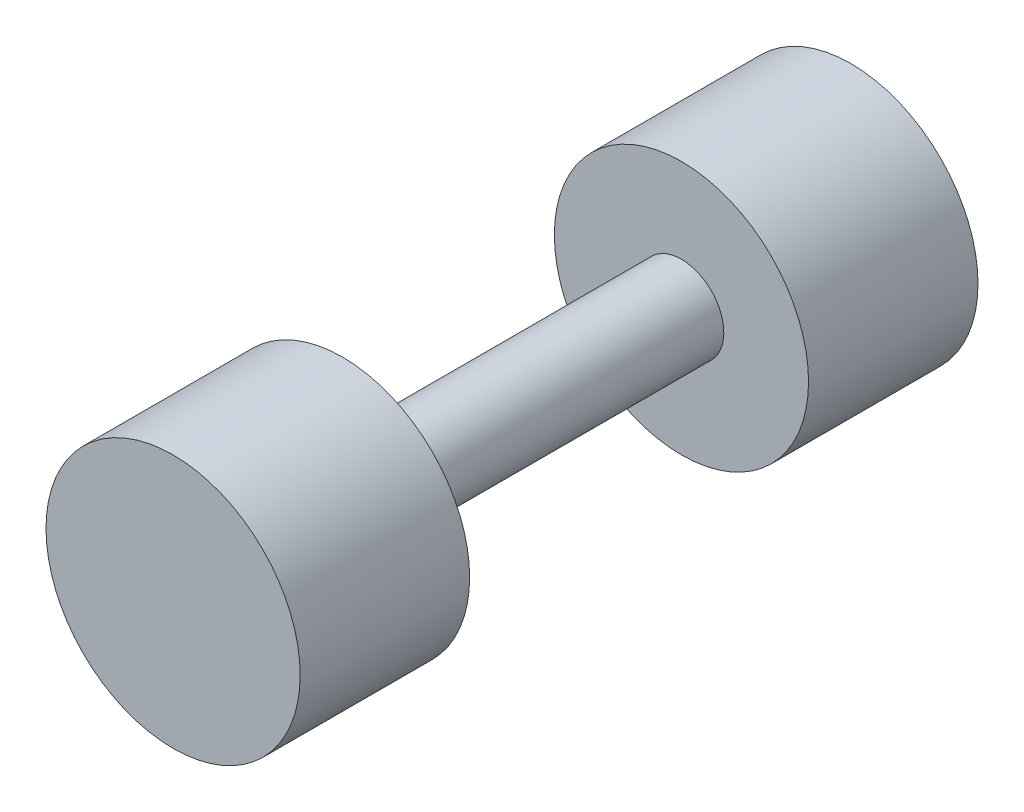
ISO-10303-21;
HEADER;
FILE_DESCRIPTION(('STEP AP214'),'2;1');
FILE_NAME('part.step','',(''),(''),'','','');
FILE_SCHEMA(('AUTOMOTIVE_DESIGN { 1 0 10303 214 1 1 1 1 }'));
ENDSEC;
DATA;
#1=APPLICATION_CONTEXT('core data for automotive mechanical design processes');
#2=APPLICATION_PROTOCOL_DEFINITION('international standard','automotive_design',2000,#1);
#3=PRODUCT_CONTEXT('',#1,'mechanical');
#4=PRODUCT('Part','Part','',(#3));
#5=PRODUCT_RELATED_PRODUCT_CATEGORY('part','',(#4));
#6=PRODUCT_DEFINITION_FORMATION('','',#4);
#7=PRODUCT_DEFINITION_CONTEXT('part definition',#1,'design');
#8=PRODUCT_DEFINITION('design','',#6,#7);
#9=PRODUCT_DEFINITION_SHAPE('','',#8);
#10=(LENGTH_UNIT() NAMED_UNIT(*) SI_UNIT(.MILLI.,.METRE.));
#11=(NAMED_UNIT(*) PLANE_ANGLE_UNIT() SI_UNIT($,.RADIAN.));
#12=(NAMED_UNIT(*) SI_UNIT($,.STERADIAN.) SOLID_ANGLE_UNIT());
#13=UNCERTAINTY_MEASURE_WITH_UNIT(LENGTH_MEASURE(1.E-05),#10,'distance_accuracy_value','');
#14=(GEOMETRIC_REPRESENTATION_CONTEXT(3) GLOBAL_UNCERTAINTY_ASSIGNED_CONTEXT((#13)) GLOBAL_UNIT_ASSIGNED_CONTEXT((#10,
#11,#12)) REPRESENTATION_CONTEXT('',''));
#15=CARTESIAN_POINT('',(0.,0.,0.));
#16=DIRECTION('',(0.,0.,1.));
#17=DIRECTION('',(1.,0.,0.));
#18=AXIS2_PLACEMENT_3D('',#15,#16,#17);
#19=CARTESIAN_POINT('',(0.,0.,-50.8));
#20=DIRECTION('',(0.,0.,-1.));
#21=DIRECTION('',(0.,1.,0.));
#22=AXIS2_PLACEMENT_3D('',#19,#20,#21);
#23=CYLINDRICAL_SURFACE('',#22,19.05);
#24=CARTESIAN_POINT('',(0.,0.,-25.4));
#25=DIRECTION('',(0.,0.,-1.));
#26=DIRECTION('',(0.,1.,0.));
#27=AXIS2_PLACEMENT_3D('',#24,#25,#26);
#28=CIRCLE('',#27,19.05);
#29=CARTESIAN_POINT('',(0.,19.05,-25.4));
#30=VERTEX_POINT('',#29);
#31=EDGE_CURVE('E53',#30,#30,#28,.T.);
#32=ORIENTED_EDGE('',*,*,#31,.T.);
#33=EDGE_LOOP('',(#32));
#34=FACE_BOUND('',#33,.T.);
#35=CARTESIAN_POINT('',(0.,0.,-50.8));
#36=DIRECTION('',(0.,0.,-1.));
#37=DIRECTION('',(0.,1.,0.));
#38=AXIS2_PLACEMENT_3D('',#35,#36,#37);
#39=CIRCLE('',#38,19.05);
#40=CARTESIAN_POINT('',(0.,19.05,-50.8));
#41=VERTEX_POINT('',#40);
#42=EDGE_CURVE('E10',#41,#41,#39,.T.);
#43=ORIENTED_EDGE('',*,*,#42,.F.);
#44=EDGE_LOOP('',(#43));
#45=FACE_BOUND('',#44,.T.);
#46=ADVANCED_FACE('F31',(#34,#45),#23,.T.);
#47=CARTESIAN_POINT('',(0.,19.05,-50.8));
#48=DIRECTION('',(0.,0.,-1.));
#49=DIRECTION('',(0.,1.,0.));
#50=AXIS2_PLACEMENT_3D('',#47,#48,#49);
#51=PLANE('',#50);
#52=ORIENTED_EDGE('',*,*,#42,.T.);
#53=EDGE_LOOP('',(#52));
#54=FACE_BOUND('',#53,.T.);
#55=ADVANCED_FACE('F71',(#54),#51,.T.);
#56=CARTESIAN_POINT('',(0.,0.,50.8));
#57=DIRECTION('',(0.,0.,1.));
#58=DIRECTION('',(0.,-1.,0.));
#59=AXIS2_PLACEMENT_3D('',#56,#57,#58);
#60=PLANE('',#59);
#61=CARTESIAN_POINT('',(0.,0.,50.8));
#62=DIRECTION('',(0.,0.,-1.));
#63=DIRECTION('',(0.,1.,0.));
#64=AXIS2_PLACEMENT_3D('',#61,#62,#63);
#65=CIRCLE('',#64,19.05);
#66=CARTESIAN_POINT('',(0.,19.05,50.8));
#67=VERTEX_POINT('',#66);
#68=EDGE_CURVE('E37',#67,#67,#65,.T.);
#69=ORIENTED_EDGE('',*,*,#68,.F.);
#70=EDGE_LOOP('',(#69));
#71=FACE_BOUND('',#70,.T.);
#72=ADVANCED_FACE('F75',(#71),#60,.T.);
#73=CARTESIAN_POINT('',(0.,0.,-50.8));
#74=DIRECTION('',(0.,0.,-1.));
#75=DIRECTION('',(0.,1.,0.));
#76=AXIS2_PLACEMENT_3D('',#73,#74,#75);
#77=CYLINDRICAL_SURFACE('',#76,19.05);
#78=ORIENTED_EDGE('',*,*,#68,.T.);
#79=EDGE_LOOP('',(#78));
#80=FACE_BOUND('',#79,.T.);
#81=CARTESIAN_POINT('',(0.,0.,25.4));
#82=DIRECTION('',(0.,0.,-1.));
#83=DIRECTION('',(0.,1.,0.));
#84=AXIS2_PLACEMENT_3D('',#81,#82,#83);
#85=CIRCLE('',#84,19.05);
#86=CARTESIAN_POINT('',(0.,19.05,25.4));
#87=VERTEX_POINT('',#86);
#88=EDGE_CURVE('E41',#87,#87,#85,.T.);
#89=ORIENTED_EDGE('',*,*,#88,.F.);
#90=EDGE_LOOP('',(#89));
#91=FACE_BOUND('',#90,.T.);
#92=ADVANCED_FACE('F79',(#80,#91),#77,.T.);
#93=CARTESIAN_POINT('',(0.,19.05,25.4));
#94=DIRECTION('',(0.,0.,-1.));
#95=DIRECTION('',(0.,1.,0.));
#96=AXIS2_PLACEMENT_3D('',#93,#94,#95);
#97=PLANE('',#96);
#98=ORIENTED_EDGE('',*,*,#88,.T.);
#99=EDGE_LOOP('',(#98));
#100=FACE_BOUND('',#99,.T.);
#101=CARTESIAN_POINT('',(0.,0.,25.4));
#102=DIRECTION('',(0.,0.,-1.));
#103=DIRECTION('',(0.,1.,0.));
#104=AXIS2_PLACEMENT_3D('',#101,#102,#103);
#105=CIRCLE('',#104,6.35000000000001);
#106=CARTESIAN_POINT('',(0.,6.34999999999999,25.4));
#107=VERTEX_POINT('',#106);
#108=EDGE_CURVE('E45',#107,#107,#105,.T.);
#109=ORIENTED_EDGE('',*,*,#108,.F.);
#110=EDGE_LOOP('',(#109));
#111=FACE_BOUND('',#110,.T.);
#112=ADVANCED_FACE('F67',(#100,#111),#97,.T.);
#113=CARTESIAN_POINT('',(0.,0.,-50.8));
#114=DIRECTION('',(0.,0.,-1.));
#115=DIRECTION('',(0.,1.,0.));
#116=AXIS2_PLACEMENT_3D('',#113,#114,#115);
#117=CYLINDRICAL_SURFACE('',#116,6.35000000000001);
#118=ORIENTED_EDGE('',*,*,#108,.T.);
#119=EDGE_LOOP('',(#118));
#120=FACE_BOUND('',#119,.T.);
#121=CARTESIAN_POINT('',(0.,0.,-25.4));
#122=DIRECTION('',(0.,0.,-1.));
#123=DIRECTION('',(0.,1.,0.));
#124=AXIS2_PLACEMENT_3D('',#121,#122,#123);
#125=CIRCLE('',#124,6.35000000000001);
#126=CARTESIAN_POINT('',(0.,6.35,-25.4));
#127=VERTEX_POINT('',#126);
#128=EDGE_CURVE('E50',#127,#127,#125,.T.);
#129=ORIENTED_EDGE('',*,*,#128,.F.);
#130=EDGE_LOOP('',(#129));
#131=FACE_BOUND('',#130,.T.);
#132=ADVANCED_FACE('F61',(#120,#131),#117,.T.);
#133=CARTESIAN_POINT('',(0.,6.35,-25.4));
#134=DIRECTION('',(0.,0.,1.));
#135=DIRECTION('',(0.,-1.,0.));
#136=AXIS2_PLACEMENT_3D('',#133,#134,#135);
#137=PLANE('',#136);
#138=ORIENTED_EDGE('',*,*,#128,.T.);
#139=EDGE_LOOP('',(#138));
#140=FACE_BOUND('',#139,.T.);
#141=ORIENTED_EDGE('',*,*,#31,.F.);
#142=EDGE_LOOP('',(#141));
#143=FACE_BOUND('',#142,.T.);
#144=ADVANCED_FACE('F59',(#140,#143),#137,.T.);
#145=CLOSED_SHELL('',(#46,#55,#72,#92,#112,#132,#144));
#146=MANIFOLD_SOLID_BREP('B2',#145);
#147=ADVANCED_BREP_SHAPE_REPRESENTATION('',(#18,#146),#14);
#148=SHAPE_DEFINITION_REPRESENTATION(#9,#147);
ENDSEC;
END-ISO-10303-21;
